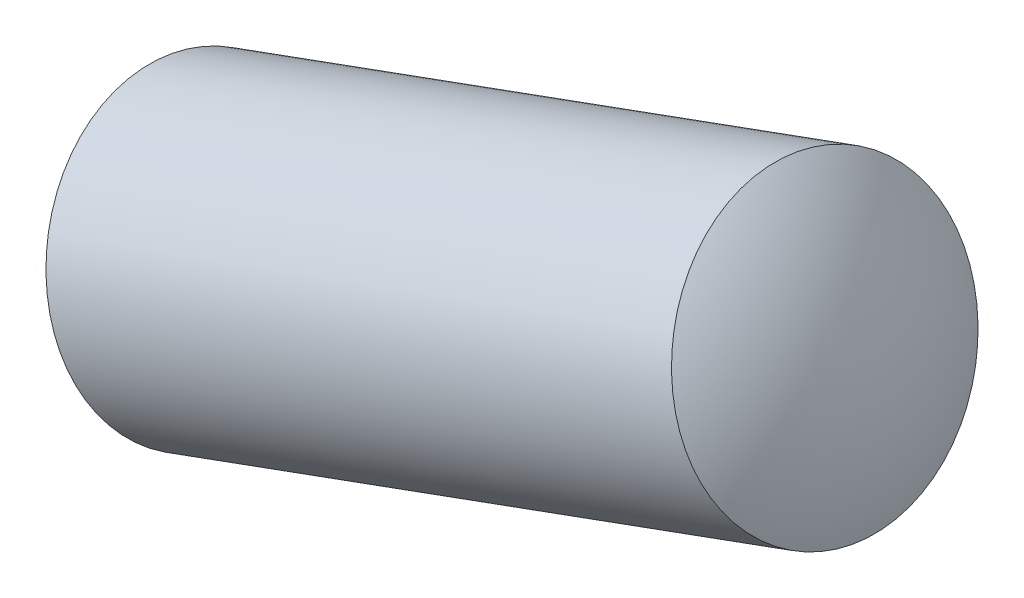
ISO-10303-21;
HEADER;
FILE_DESCRIPTION(('STEP AP214'),'2;1');
FILE_NAME('part.step','',(''),(''),'','','');
FILE_SCHEMA(('AUTOMOTIVE_DESIGN { 1 0 10303 214 1 1 1 1 }'));
ENDSEC;
DATA;
#1=APPLICATION_CONTEXT('core data for automotive mechanical design processes');
#2=APPLICATION_PROTOCOL_DEFINITION('international standard','automotive_design',2000,#1);
#3=PRODUCT_CONTEXT('',#1,'mechanical');
#4=PRODUCT('Part','Part','',(#3));
#5=PRODUCT_RELATED_PRODUCT_CATEGORY('part','',(#4));
#6=PRODUCT_DEFINITION_FORMATION('','',#4);
#7=PRODUCT_DEFINITION_CONTEXT('part definition',#1,'design');
#8=PRODUCT_DEFINITION('design','',#6,#7);
#9=PRODUCT_DEFINITION_SHAPE('','',#8);
#10=(LENGTH_UNIT() NAMED_UNIT(*) SI_UNIT(.MILLI.,.METRE.));
#11=(NAMED_UNIT(*) PLANE_ANGLE_UNIT() SI_UNIT($,.RADIAN.));
#12=(NAMED_UNIT(*) SI_UNIT($,.STERADIAN.) SOLID_ANGLE_UNIT());
#13=UNCERTAINTY_MEASURE_WITH_UNIT(LENGTH_MEASURE(1.E-05),#10,'distance_accuracy_value','');
#14=(GEOMETRIC_REPRESENTATION_CONTEXT(3) GLOBAL_UNCERTAINTY_ASSIGNED_CONTEXT((#13)) GLOBAL_UNIT_ASSIGNED_CONTEXT((#10,
#11,#12)) REPRESENTATION_CONTEXT('',''));
#15=CARTESIAN_POINT('',(0.,0.,0.));
#16=DIRECTION('',(0.,0.,1.));
#17=DIRECTION('',(1.,0.,0.));
#18=AXIS2_PLACEMENT_3D('',#15,#16,#17);
#19=CARTESIAN_POINT('',(-20.9662994784114,-7.63426406705869,0.6));
#20=DIRECTION('',(-0.342145002940637,0.939647166208014,0.));
#21=DIRECTION('',(-0.939647166208015,-0.342145002940636,0.));
#22=AXIS2_PLACEMENT_3D('',#19,#20,#21);
#23=SPHERICAL_SURFACE('',#22,2.);
#24=CARTESIAN_POINT('',(-20.9662994784114,-7.63426406705869,0.6));
#25=DIRECTION('',(0.939647166208014,0.342145002940637,0.));
#26=DIRECTION('',(0.,0.,-1.));
#27=AXIS2_PLACEMENT_3D('',#24,#25,#26);
#28=SPHERICAL_SURFACE('',#27,2.);
#29=CARTESIAN_POINT('',(-22.5938161114717,-8.22687659570764,0.600000000000017));
#30=DIRECTION('',(0.939647166208014,0.342145002940637,0.));
#31=DIRECTION('',(0.,0.,-1.));
#32=AXIS2_PLACEMENT_3D('',#29,#30,#31);
#33=CIRCLE('',#32,1.);
#34=CARTESIAN_POINT('',(-22.5938161114717,-8.22687659570764,-0.399999999999983));
#35=VERTEX_POINT('',#34);
#36=EDGE_CURVE('E11',#35,#35,#33,.T.);
#37=ORIENTED_EDGE('',*,*,#36,.F.);
#38=EDGE_LOOP('',(#37));
#39=FACE_BOUND('',#38,.T.);
#40=ADVANCED_FACE('F17',(#39),#28,.T.);
#41=CARTESIAN_POINT('',(-19.9083522516374,-7.24904356085909,0.6));
#42=DIRECTION('',(-0.342145002940637,0.939647166208014,0.));
#43=DIRECTION('',(0.939647166208014,0.342145002940637,0.));
#44=AXIS2_PLACEMENT_3D('',#41,#42,#43);
#45=SPHERICAL_SURFACE('',#44,2.);
#46=CARTESIAN_POINT('',(-19.9083522516374,-7.24904356085909,0.6));
#47=DIRECTION('',(0.939647166208014,0.342145002940637,0.));
#48=DIRECTION('',(0.,0.,-1.));
#49=AXIS2_PLACEMENT_3D('',#46,#47,#48);
#50=SPHERICAL_SURFACE('',#49,2.);
#51=CARTESIAN_POINT('',(-18.2808356185769,-6.65643103221003,0.6));
#52=DIRECTION('',(0.939647166208014,0.342145002940637,0.));
#53=DIRECTION('',(0.,0.,-1.));
#54=AXIS2_PLACEMENT_3D('',#51,#52,#53);
#55=CIRCLE('',#54,1.);
#56=CARTESIAN_POINT('',(-18.2808356185769,-6.65643103221003,-0.4));
#57=VERTEX_POINT('',#56);
#58=EDGE_CURVE('E21',#57,#57,#55,.T.);
#59=ORIENTED_EDGE('',*,*,#58,.T.);
#60=EDGE_LOOP('',(#59));
#61=FACE_BOUND('',#60,.T.);
#62=ADVANCED_FACE('F19',(#61),#50,.T.);
#63=CARTESIAN_POINT('',(-19.3590807418006,-7.04904242308446,0.6));
#64=DIRECTION('',(0.939647166208014,0.342145002940637,0.));
#65=DIRECTION('',(0.,0.,-1.));
#66=AXIS2_PLACEMENT_3D('',#63,#64,#65);
#67=CYLINDRICAL_SURFACE('',#66,1.);
#68=ORIENTED_EDGE('',*,*,#36,.T.);
#69=EDGE_LOOP('',(#68));
#70=FACE_BOUND('',#69,.T.);
#71=ORIENTED_EDGE('',*,*,#58,.F.);
#72=EDGE_LOOP('',(#71));
#73=FACE_BOUND('',#72,.T.);
#74=ADVANCED_FACE('F47',(#70,#73),#67,.T.);
#75=CLOSED_SHELL('',(#40,#62,#74));
#76=MANIFOLD_SOLID_BREP('B1',#75);
#77=ADVANCED_BREP_SHAPE_REPRESENTATION('',(#18,#76),#14);
#78=SHAPE_DEFINITION_REPRESENTATION(#9,#77);
ENDSEC;
END-ISO-10303-21;
